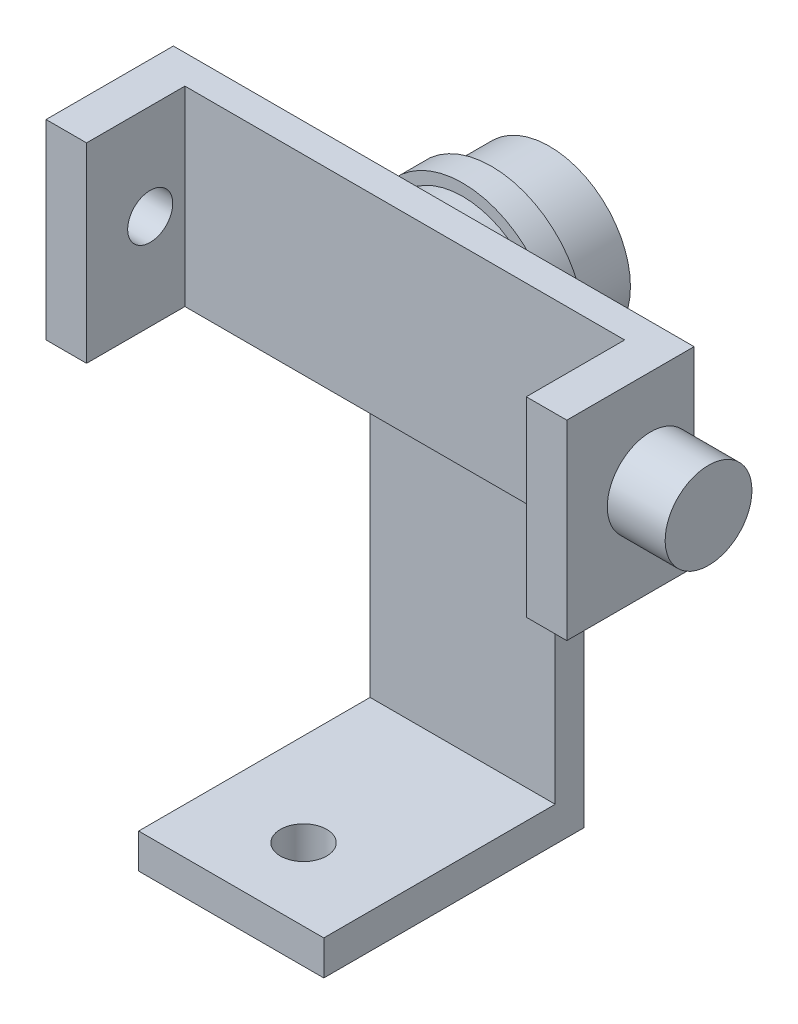
ISO-10303-21;
HEADER;
FILE_DESCRIPTION(('STEP AP214'),'2;1');
FILE_NAME('part.step','',(''),(''),'','','');
FILE_SCHEMA(('AUTOMOTIVE_DESIGN { 1 0 10303 214 1 1 1 1 }'));
ENDSEC;
DATA;
#1=APPLICATION_CONTEXT('core data for automotive mechanical design processes');
#2=APPLICATION_PROTOCOL_DEFINITION('international standard','automotive_design',2000,#1);
#3=PRODUCT_CONTEXT('',#1,'mechanical');
#4=PRODUCT('Part','Part','',(#3));
#5=PRODUCT_RELATED_PRODUCT_CATEGORY('part','',(#4));
#6=PRODUCT_DEFINITION_FORMATION('','',#4);
#7=PRODUCT_DEFINITION_CONTEXT('part definition',#1,'design');
#8=PRODUCT_DEFINITION('design','',#6,#7);
#9=PRODUCT_DEFINITION_SHAPE('','',#8);
#10=(LENGTH_UNIT() NAMED_UNIT(*) SI_UNIT(.MILLI.,.METRE.));
#11=(NAMED_UNIT(*) PLANE_ANGLE_UNIT() SI_UNIT($,.RADIAN.));
#12=(NAMED_UNIT(*) SI_UNIT($,.STERADIAN.) SOLID_ANGLE_UNIT());
#13=UNCERTAINTY_MEASURE_WITH_UNIT(LENGTH_MEASURE(1.E-05),#10,'distance_accuracy_value','');
#14=(GEOMETRIC_REPRESENTATION_CONTEXT(3) GLOBAL_UNCERTAINTY_ASSIGNED_CONTEXT((#13)) GLOBAL_UNIT_ASSIGNED_CONTEXT((#10,
#11,#12)) REPRESENTATION_CONTEXT('',''));
#15=CARTESIAN_POINT('',(0.,0.,0.));
#16=DIRECTION('',(0.,0.,1.));
#17=DIRECTION('',(1.,0.,0.));
#18=AXIS2_PLACEMENT_3D('',#15,#16,#17);
#19=CARTESIAN_POINT('',(0.,0.,-17.5));
#20=DIRECTION('',(0.,0.,1.));
#21=DIRECTION('',(1.,0.,0.));
#22=AXIS2_PLACEMENT_3D('',#19,#20,#21);
#23=PLANE('',#22);
#24=DIRECTION('',(1.,0.,0.));
#25=VECTOR('',#24,1.);
#26=CARTESIAN_POINT('',(-45.,58.5,-17.5));
#27=LINE('',#26,#25);
#28=CARTESIAN_POINT('',(-38.,58.5,-17.5));
#29=VERTEX_POINT('',#28);
#30=CARTESIAN_POINT('',(38.,58.5,-17.5));
#31=VERTEX_POINT('',#30);
#32=EDGE_CURVE('E86',#29,#31,#27,.T.);
#33=ORIENTED_EDGE('',*,*,#32,.T.);
#34=DIRECTION('',(0.,-1.,0.));
#35=VECTOR('',#34,1.);
#36=CARTESIAN_POINT('',(38.,91.5,-17.5));
#37=LINE('',#36,#35);
#38=CARTESIAN_POINT('',(38.,91.5,-17.5));
#39=VERTEX_POINT('',#38);
#40=EDGE_CURVE('E81',#39,#31,#37,.T.);
#41=ORIENTED_EDGE('',*,*,#40,.F.);
#42=DIRECTION('',(-1.,0.,0.));
#43=VECTOR('',#42,1.);
#44=CARTESIAN_POINT('',(-45.,91.5,-17.5));
#45=LINE('',#44,#43);
#46=CARTESIAN_POINT('',(-38.,91.5,-17.5));
#47=VERTEX_POINT('',#46);
#48=EDGE_CURVE('E199',#39,#47,#45,.T.);
#49=ORIENTED_EDGE('',*,*,#48,.T.);
#50=DIRECTION('',(0.,1.,0.));
#51=VECTOR('',#50,1.);
#52=CARTESIAN_POINT('',(-38.,91.5,-17.5));
#53=LINE('',#52,#51);
#54=EDGE_CURVE('E625',#29,#47,#53,.T.);
#55=ORIENTED_EDGE('',*,*,#54,.F.);
#56=EDGE_LOOP('',(#33,#41,#49,#55));
#57=FACE_BOUND('',#56,.T.);
#58=ADVANCED_FACE('F63',(#57),#23,.T.);
#59=CARTESIAN_POINT('',(-16.,6.,-32.5));
#60=DIRECTION('',(0.,0.,1.));
#61=DIRECTION('',(1.,0.,0.));
#62=AXIS2_PLACEMENT_3D('',#59,#60,#61);
#63=PLANE('',#62);
#64=CARTESIAN_POINT('',(0.,75.,-32.5));
#65=DIRECTION('',(0.,0.,1.));
#66=DIRECTION('',(1.,0.,0.));
#67=AXIS2_PLACEMENT_3D('',#64,#65,#66);
#68=CIRCLE('',#67,14.);
#69=CARTESIAN_POINT('',(14.,75.,-32.5));
#70=VERTEX_POINT('',#69);
#71=EDGE_CURVE('E217',#70,#70,#68,.T.);
#72=ORIENTED_EDGE('',*,*,#71,.T.);
#73=EDGE_LOOP('',(#72));
#74=FACE_BOUND('',#73,.T.);
#75=CARTESIAN_POINT('',(0.,75.,-32.5));
#76=DIRECTION('',(0.,0.,1.));
#77=DIRECTION('',(1.,0.,0.));
#78=AXIS2_PLACEMENT_3D('',#75,#76,#77);
#79=CIRCLE('',#78,16.);
#80=CARTESIAN_POINT('',(-16.,75.,-32.5));
#81=VERTEX_POINT('',#80);
#82=CARTESIAN_POINT('',(16.,75.,-32.5));
#83=VERTEX_POINT('',#82);
#84=EDGE_CURVE('E231',#81,#83,#79,.F.);
#85=ORIENTED_EDGE('',*,*,#84,.T.);
#86=DIRECTION('',(0.,-1.,0.));
#87=VECTOR('',#86,1.);
#88=CARTESIAN_POINT('',(16.,6.,-32.5));
#89=LINE('',#88,#87);
#90=CARTESIAN_POINT('',(16.,0.,-32.5));
#91=VERTEX_POINT('',#90);
#92=EDGE_CURVE('E280',#83,#91,#89,.T.);
#93=ORIENTED_EDGE('',*,*,#92,.T.);
#94=DIRECTION('',(-1.,0.,0.));
#95=VECTOR('',#94,1.);
#96=CARTESIAN_POINT('',(-16.,0.,-32.5));
#97=LINE('',#96,#95);
#98=CARTESIAN_POINT('',(-16.,0.,-32.5));
#99=VERTEX_POINT('',#98);
#100=EDGE_CURVE('E257',#91,#99,#97,.T.);
#101=ORIENTED_EDGE('',*,*,#100,.T.);
#102=DIRECTION('',(0.,-1.,0.));
#103=VECTOR('',#102,1.);
#104=CARTESIAN_POINT('',(-16.,6.,-32.5));
#105=LINE('',#104,#103);
#106=EDGE_CURVE('E264',#81,#99,#105,.T.);
#107=ORIENTED_EDGE('',*,*,#106,.F.);
#108=EDGE_LOOP('',(#85,#93,#101,#107));
#109=FACE_BOUND('',#108,.T.);
#110=ADVANCED_FACE('F310',(#74,#109),#63,.F.);
#111=CARTESIAN_POINT('',(-16.,91.,-27.5));
#112=DIRECTION('',(0.,0.,-1.));
#113=DIRECTION('',(-1.,0.,0.));
#114=AXIS2_PLACEMENT_3D('',#111,#112,#113);
#115=PLANE('',#114);
#116=CARTESIAN_POINT('',(0.,75.,-27.5));
#117=DIRECTION('',(0.,0.,-1.));
#118=DIRECTION('',(-1.,0.,0.));
#119=AXIS2_PLACEMENT_3D('',#116,#117,#118);
#120=CIRCLE('',#119,14.);
#121=CARTESIAN_POINT('',(-14.,75.,-27.5));
#122=VERTEX_POINT('',#121);
#123=EDGE_CURVE('E216',#122,#122,#120,.T.);
#124=ORIENTED_EDGE('',*,*,#123,.T.);
#125=EDGE_LOOP('',(#124));
#126=FACE_BOUND('',#125,.T.);
#127=DIRECTION('',(0.,-1.,0.));
#128=VECTOR('',#127,1.);
#129=CARTESIAN_POINT('',(16.,91.,-27.5));
#130=LINE('',#129,#128);
#131=CARTESIAN_POINT('',(16.,75.,-27.5));
#132=VERTEX_POINT('',#131);
#133=CARTESIAN_POINT('',(16.,6.,-27.5));
#134=VERTEX_POINT('',#133);
#135=EDGE_CURVE('E238',#132,#134,#130,.T.);
#136=ORIENTED_EDGE('',*,*,#135,.F.);
#137=CARTESIAN_POINT('',(0.,75.,-27.5));
#138=DIRECTION('',(0.,0.,1.));
#139=DIRECTION('',(1.,0.,0.));
#140=AXIS2_PLACEMENT_3D('',#137,#138,#139);
#141=CIRCLE('',#140,16.);
#142=CARTESIAN_POINT('',(-16.,75.,-27.5));
#143=VERTEX_POINT('',#142);
#144=EDGE_CURVE('E225',#143,#132,#141,.F.);
#145=ORIENTED_EDGE('',*,*,#144,.F.);
#146=DIRECTION('',(0.,-1.,0.));
#147=VECTOR('',#146,1.);
#148=CARTESIAN_POINT('',(-16.,91.,-27.5));
#149=LINE('',#148,#147);
#150=CARTESIAN_POINT('',(-16.,6.,-27.5));
#151=VERTEX_POINT('',#150);
#152=EDGE_CURVE('E241',#143,#151,#149,.T.);
#153=ORIENTED_EDGE('',*,*,#152,.T.);
#154=DIRECTION('',(1.,0.,0.));
#155=VECTOR('',#154,1.);
#156=CARTESIAN_POINT('',(-16.,6.,-27.5));
#157=LINE('',#156,#155);
#158=EDGE_CURVE('E234',#151,#134,#157,.T.);
#159=ORIENTED_EDGE('',*,*,#158,.T.);
#160=EDGE_LOOP('',(#136,#145,#153,#159));
#161=FACE_BOUND('',#160,.T.);
#162=ADVANCED_FACE('F289',(#126,#161),#115,.F.);
#163=CARTESIAN_POINT('',(16.,6.,-32.5));
#164=DIRECTION('',(-1.,0.,0.));
#165=DIRECTION('',(0.,0.,1.));
#166=AXIS2_PLACEMENT_3D('',#163,#164,#165);
#167=PLANE('',#166);
#168=DIRECTION('',(0.,0.,1.));
#169=VECTOR('',#168,1.);
#170=CARTESIAN_POINT('',(16.,75.,-112.5));
#171=LINE('',#170,#169);
#172=EDGE_CURVE('E221',#83,#132,#171,.T.);
#173=ORIENTED_EDGE('',*,*,#172,.T.);
#174=ORIENTED_EDGE('',*,*,#135,.T.);
#175=DIRECTION('',(0.,0.,-1.));
#176=VECTOR('',#175,1.);
#177=CARTESIAN_POINT('',(16.,6.,-32.5));
#178=LINE('',#177,#176);
#179=CARTESIAN_POINT('',(16.,6.,12.5));
#180=VERTEX_POINT('',#179);
#181=EDGE_CURVE('E260',#180,#134,#178,.T.);
#182=ORIENTED_EDGE('',*,*,#181,.F.);
#183=DIRECTION('',(0.,-1.,0.));
#184=VECTOR('',#183,1.);
#185=CARTESIAN_POINT('',(16.,6.,12.5));
#186=LINE('',#185,#184);
#187=CARTESIAN_POINT('',(16.,0.,12.5));
#188=VERTEX_POINT('',#187);
#189=EDGE_CURVE('E73',#180,#188,#186,.T.);
#190=ORIENTED_EDGE('',*,*,#189,.T.);
#191=DIRECTION('',(0.,0.,-1.));
#192=VECTOR('',#191,1.);
#193=CARTESIAN_POINT('',(16.,0.,-32.5));
#194=LINE('',#193,#192);
#195=EDGE_CURVE('E271',#188,#91,#194,.T.);
#196=ORIENTED_EDGE('',*,*,#195,.T.);
#197=ORIENTED_EDGE('',*,*,#92,.F.);
#198=EDGE_LOOP('',(#173,#174,#182,#190,#196,#197));
#199=FACE_BOUND('',#198,.T.);
#200=ADVANCED_FACE('F352',(#199),#167,.F.);
#201=CARTESIAN_POINT('',(0.,6.,0.));
#202=DIRECTION('',(0.,1.,0.));
#203=DIRECTION('',(0.,0.,1.));
#204=AXIS2_PLACEMENT_3D('',#201,#202,#203);
#205=PLANE('',#204);
#206=ORIENTED_EDGE('',*,*,#158,.F.);
#207=DIRECTION('',(0.,0.,1.));
#208=VECTOR('',#207,1.);
#209=CARTESIAN_POINT('',(-16.,6.,-32.5));
#210=LINE('',#209,#208);
#211=CARTESIAN_POINT('',(-16.,6.,12.5));
#212=VERTEX_POINT('',#211);
#213=EDGE_CURVE('E253',#151,#212,#210,.T.);
#214=ORIENTED_EDGE('',*,*,#213,.T.);
#215=DIRECTION('',(1.,0.,0.));
#216=VECTOR('',#215,1.);
#217=CARTESIAN_POINT('',(-16.,6.,12.5));
#218=LINE('',#217,#216);
#219=EDGE_CURVE('E256',#212,#180,#218,.T.);
#220=ORIENTED_EDGE('',*,*,#219,.T.);
#221=ORIENTED_EDGE('',*,*,#181,.T.);
#222=EDGE_LOOP('',(#206,#214,#220,#221));
#223=FACE_BOUND('',#222,.T.);
#224=CARTESIAN_POINT('',(0.,6.,0.));
#225=DIRECTION('',(0.,1.,0.));
#226=DIRECTION('',(0.,0.,1.));
#227=AXIS2_PLACEMENT_3D('',#224,#225,#226);
#228=CIRCLE('',#227,4.);
#229=CARTESIAN_POINT('',(0.,6.,4.));
#230=VERTEX_POINT('',#229);
#231=EDGE_CURVE('E245',#230,#230,#228,.T.);
#232=ORIENTED_EDGE('',*,*,#231,.F.);
#233=EDGE_LOOP('',(#232));
#234=FACE_BOUND('',#233,.T.);
#235=ADVANCED_FACE('F367',(#223,#234),#205,.T.);
#236=CARTESIAN_POINT('',(0.,0.,0.));
#237=DIRECTION('',(0.,1.,0.));
#238=DIRECTION('',(0.,0.,1.));
#239=AXIS2_PLACEMENT_3D('',#236,#237,#238);
#240=PLANE('',#239);
#241=DIRECTION('',(0.,0.,1.));
#242=VECTOR('',#241,1.);
#243=CARTESIAN_POINT('',(-16.,0.,-32.5));
#244=LINE('',#243,#242);
#245=CARTESIAN_POINT('',(-16.,0.,12.5));
#246=VERTEX_POINT('',#245);
#247=EDGE_CURVE('E249',#99,#246,#244,.T.);
#248=ORIENTED_EDGE('',*,*,#247,.F.);
#249=ORIENTED_EDGE('',*,*,#100,.F.);
#250=ORIENTED_EDGE('',*,*,#195,.F.);
#251=DIRECTION('',(1.,0.,0.));
#252=VECTOR('',#251,1.);
#253=CARTESIAN_POINT('',(-16.,0.,12.5));
#254=LINE('',#253,#252);
#255=EDGE_CURVE('E268',#246,#188,#254,.T.);
#256=ORIENTED_EDGE('',*,*,#255,.F.);
#257=EDGE_LOOP('',(#248,#249,#250,#256));
#258=FACE_BOUND('',#257,.T.);
#259=CARTESIAN_POINT('',(0.,0.,0.));
#260=DIRECTION('',(0.,1.,0.));
#261=DIRECTION('',(0.,0.,1.));
#262=AXIS2_PLACEMENT_3D('',#259,#260,#261);
#263=CIRCLE('',#262,4.);
#264=CARTESIAN_POINT('',(0.,0.,4.));
#265=VERTEX_POINT('',#264);
#266=EDGE_CURVE('E244',#265,#265,#263,.T.);
#267=ORIENTED_EDGE('',*,*,#266,.T.);
#268=EDGE_LOOP('',(#267));
#269=FACE_BOUND('',#268,.T.);
#270=ADVANCED_FACE('F359',(#258,#269),#240,.F.);
#271=CARTESIAN_POINT('',(-16.,6.,-32.5));
#272=DIRECTION('',(1.,0.,0.));
#273=DIRECTION('',(0.,0.,-1.));
#274=AXIS2_PLACEMENT_3D('',#271,#272,#273);
#275=PLANE('',#274);
#276=ORIENTED_EDGE('',*,*,#152,.F.);
#277=DIRECTION('',(0.,0.,1.));
#278=VECTOR('',#277,1.);
#279=CARTESIAN_POINT('',(-16.,75.,-112.5));
#280=LINE('',#279,#278);
#281=EDGE_CURVE('E228',#81,#143,#280,.T.);
#282=ORIENTED_EDGE('',*,*,#281,.F.);
#283=ORIENTED_EDGE('',*,*,#106,.T.);
#284=ORIENTED_EDGE('',*,*,#247,.T.);
#285=DIRECTION('',(0.,-1.,0.));
#286=VECTOR('',#285,1.);
#287=CARTESIAN_POINT('',(-16.,6.,12.5));
#288=LINE('',#287,#286);
#289=EDGE_CURVE('E12',#212,#246,#288,.T.);
#290=ORIENTED_EDGE('',*,*,#289,.F.);
#291=ORIENTED_EDGE('',*,*,#213,.F.);
#292=EDGE_LOOP('',(#276,#282,#283,#284,#290,#291));
#293=FACE_BOUND('',#292,.T.);
#294=ADVANCED_FACE('F65',(#293),#275,.F.);
#295=CARTESIAN_POINT('',(-16.,6.,12.5));
#296=DIRECTION('',(0.,0.,-1.));
#297=DIRECTION('',(-1.,0.,0.));
#298=AXIS2_PLACEMENT_3D('',#295,#296,#297);
#299=PLANE('',#298);
#300=ORIENTED_EDGE('',*,*,#255,.T.);
#301=ORIENTED_EDGE('',*,*,#189,.F.);
#302=ORIENTED_EDGE('',*,*,#219,.F.);
#303=ORIENTED_EDGE('',*,*,#289,.T.);
#304=EDGE_LOOP('',(#300,#301,#302,#303));
#305=FACE_BOUND('',#304,.T.);
#306=ADVANCED_FACE('F371',(#305),#299,.F.);
#307=CARTESIAN_POINT('',(0.,6.,0.));
#308=DIRECTION('',(0.,-1.,0.));
#309=DIRECTION('',(0.,0.,-1.));
#310=AXIS2_PLACEMENT_3D('',#307,#308,#309);
#311=CYLINDRICAL_SURFACE('',#310,4.);
#312=ORIENTED_EDGE('',*,*,#231,.T.);
#313=EDGE_LOOP('',(#312));
#314=FACE_BOUND('',#313,.T.);
#315=ORIENTED_EDGE('',*,*,#266,.F.);
#316=EDGE_LOOP('',(#315));
#317=FACE_BOUND('',#316,.T.);
#318=ADVANCED_FACE('F304',(#314,#317),#311,.F.);
#319=CARTESIAN_POINT('',(0.,75.,-112.5));
#320=DIRECTION('',(0.,0.,1.));
#321=DIRECTION('',(1.,0.,0.));
#322=AXIS2_PLACEMENT_3D('',#319,#320,#321);
#323=CYLINDRICAL_SURFACE('',#322,16.);
#324=ORIENTED_EDGE('',*,*,#281,.T.);
#325=ORIENTED_EDGE('',*,*,#144,.T.);
#326=ORIENTED_EDGE('',*,*,#172,.F.);
#327=ORIENTED_EDGE('',*,*,#84,.F.);
#328=EDGE_LOOP('',(#324,#325,#326,#327));
#329=FACE_BOUND('',#328,.T.);
#330=ADVANCED_FACE('F295',(#329),#323,.T.);
#331=CARTESIAN_POINT('',(0.,75.,-42.5));
#332=DIRECTION('',(0.,0.,1.));
#333=DIRECTION('',(1.,0.,0.));
#334=AXIS2_PLACEMENT_3D('',#331,#332,#333);
#335=CYLINDRICAL_SURFACE('',#334,14.);
#336=CARTESIAN_POINT('',(0.,75.,-22.5));
#337=DIRECTION('',(0.,0.,1.));
#338=DIRECTION('',(1.,0.,0.));
#339=AXIS2_PLACEMENT_3D('',#336,#337,#338);
#340=CIRCLE('',#339,14.);
#341=CARTESIAN_POINT('',(14.,75.,-22.5));
#342=VERTEX_POINT('',#341);
#343=EDGE_CURVE('E208',#342,#342,#340,.T.);
#344=ORIENTED_EDGE('',*,*,#343,.F.);
#345=EDGE_LOOP('',(#344));
#346=FACE_BOUND('',#345,.T.);
#347=ORIENTED_EDGE('',*,*,#123,.F.);
#348=EDGE_LOOP('',(#347));
#349=FACE_BOUND('',#348,.T.);
#350=ADVANCED_FACE('F292',(#346,#349),#335,.T.);
#351=CARTESIAN_POINT('',(0.,75.,-42.5));
#352=DIRECTION('',(0.,0.,1.));
#353=DIRECTION('',(1.,0.,0.));
#354=AXIS2_PLACEMENT_3D('',#351,#352,#353);
#355=CIRCLE('',#354,14.);
#356=CARTESIAN_POINT('',(14.,75.,-42.5));
#357=VERTEX_POINT('',#356);
#358=EDGE_CURVE('E212',#357,#357,#355,.T.);
#359=ORIENTED_EDGE('',*,*,#358,.T.);
#360=EDGE_LOOP('',(#359));
#361=FACE_BOUND('',#360,.T.);
#362=ORIENTED_EDGE('',*,*,#71,.F.);
#363=EDGE_LOOP('',(#362));
#364=FACE_BOUND('',#363,.T.);
#365=ADVANCED_FACE('F294',(#361,#364),#335,.T.);
#366=CARTESIAN_POINT('',(0.,0.,-42.5));
#367=DIRECTION('',(0.,0.,1.));
#368=DIRECTION('',(1.,0.,0.));
#369=AXIS2_PLACEMENT_3D('',#366,#367,#368);
#370=PLANE('',#369);
#371=ORIENTED_EDGE('',*,*,#358,.F.);
#372=EDGE_LOOP('',(#371));
#373=FACE_BOUND('',#372,.T.);
#374=ADVANCED_FACE('F302',(#373),#370,.F.);
#375=CARTESIAN_POINT('',(-45.,91.5,-17.5));
#376=DIRECTION('',(1.,0.,0.));
#377=DIRECTION('',(0.,1.,0.));
#378=AXIS2_PLACEMENT_3D('',#375,#376,#377);
#379=PLANE('',#378);
#380=CARTESIAN_POINT('',(-45.,75.,-11.5));
#381=DIRECTION('',(-1.,0.,0.));
#382=DIRECTION('',(0.,-1.,0.));
#383=AXIS2_PLACEMENT_3D('',#380,#381,#382);
#384=CIRCLE('',#383,3.8946994971232);
#385=CARTESIAN_POINT('',(-45.,71.1053005028768,-11.5));
#386=VERTEX_POINT('',#385);
#387=EDGE_CURVE('E601',#386,#386,#384,.T.);
#388=ORIENTED_EDGE('',*,*,#387,.F.);
#389=EDGE_LOOP('',(#388));
#390=FACE_BOUND('',#389,.T.);
#391=DIRECTION('',(0.,-1.,0.));
#392=VECTOR('',#391,1.);
#393=CARTESIAN_POINT('',(-45.,91.5,-22.5));
#394=LINE('',#393,#392);
#395=CARTESIAN_POINT('',(-45.,91.5,-22.5));
#396=VERTEX_POINT('',#395);
#397=CARTESIAN_POINT('',(-45.,58.5,-22.5));
#398=VERTEX_POINT('',#397);
#399=EDGE_CURVE('E188',#396,#398,#394,.T.);
#400=ORIENTED_EDGE('',*,*,#399,.T.);
#401=DIRECTION('',(0.,0.,-1.));
#402=VECTOR('',#401,1.);
#403=CARTESIAN_POINT('',(-45.,58.5,-17.5));
#404=LINE('',#403,#402);
#405=CARTESIAN_POINT('',(-45.,58.5,-0.499999999999997));
#406=VERTEX_POINT('',#405);
#407=EDGE_CURVE('E204',#406,#398,#404,.T.);
#408=ORIENTED_EDGE('',*,*,#407,.F.);
#409=DIRECTION('',(0.,-1.,0.));
#410=VECTOR('',#409,1.);
#411=CARTESIAN_POINT('',(-45.,91.5,-0.499999999999997));
#412=LINE('',#411,#410);
#413=CARTESIAN_POINT('',(-45.,91.5,-0.499999999999997));
#414=VERTEX_POINT('',#413);
#415=EDGE_CURVE('E639',#414,#406,#412,.T.);
#416=ORIENTED_EDGE('',*,*,#415,.F.);
#417=DIRECTION('',(0.,0.,-1.));
#418=VECTOR('',#417,1.);
#419=CARTESIAN_POINT('',(-45.,91.5,-17.5));
#420=LINE('',#419,#418);
#421=EDGE_CURVE('E194',#414,#396,#420,.T.);
#422=ORIENTED_EDGE('',*,*,#421,.T.);
#423=EDGE_LOOP('',(#400,#408,#416,#422));
#424=FACE_BOUND('',#423,.T.);
#425=ADVANCED_FACE('F333',(#390,#424),#379,.F.);
#426=CARTESIAN_POINT('',(-45.,58.5,-17.5));
#427=DIRECTION('',(0.,1.,0.));
#428=DIRECTION('',(0.,0.,1.));
#429=AXIS2_PLACEMENT_3D('',#426,#427,#428);
#430=PLANE('',#429);
#431=DIRECTION('',(1.,0.,0.));
#432=VECTOR('',#431,1.);
#433=CARTESIAN_POINT('',(-45.,58.5,-22.5));
#434=LINE('',#433,#432);
#435=CARTESIAN_POINT('',(45.,58.5,-22.5));
#436=VERTEX_POINT('',#435);
#437=EDGE_CURVE('E186',#398,#436,#434,.T.);
#438=ORIENTED_EDGE('',*,*,#437,.T.);
#439=DIRECTION('',(0.,0.,-1.));
#440=VECTOR('',#439,1.);
#441=CARTESIAN_POINT('',(45.,58.5,-17.5));
#442=LINE('',#441,#440);
#443=CARTESIAN_POINT('',(45.,58.5,-0.499999999999997));
#444=VERTEX_POINT('',#443);
#445=EDGE_CURVE('E175',#444,#436,#442,.T.);
#446=ORIENTED_EDGE('',*,*,#445,.F.);
#447=DIRECTION('',(1.,0.,0.));
#448=VECTOR('',#447,1.);
#449=CARTESIAN_POINT('',(45.,58.5,-0.499999999999997));
#450=LINE('',#449,#448);
#451=CARTESIAN_POINT('',(38.,58.5,-0.499999999999997));
#452=VERTEX_POINT('',#451);
#453=EDGE_CURVE('E622',#452,#444,#450,.T.);
#454=ORIENTED_EDGE('',*,*,#453,.F.);
#455=DIRECTION('',(0.,0.,-1.));
#456=VECTOR('',#455,1.);
#457=CARTESIAN_POINT('',(38.,58.5,-0.499999999999997));
#458=LINE('',#457,#456);
#459=EDGE_CURVE('E618',#452,#31,#458,.T.);
#460=ORIENTED_EDGE('',*,*,#459,.T.);
#461=ORIENTED_EDGE('',*,*,#32,.F.);
#462=DIRECTION('',(0.,0.,-1.));
#463=VECTOR('',#462,1.);
#464=CARTESIAN_POINT('',(-38.,58.5,-0.499999999999997));
#465=LINE('',#464,#463);
#466=CARTESIAN_POINT('',(-38.,58.5,-0.499999999999997));
#467=VERTEX_POINT('',#466);
#468=EDGE_CURVE('E660',#467,#29,#465,.T.);
#469=ORIENTED_EDGE('',*,*,#468,.F.);
#470=DIRECTION('',(1.,0.,0.));
#471=VECTOR('',#470,1.);
#472=CARTESIAN_POINT('',(-45.,58.5,-0.499999999999997));
#473=LINE('',#472,#471);
#474=EDGE_CURVE('E643',#406,#467,#473,.T.);
#475=ORIENTED_EDGE('',*,*,#474,.F.);
#476=ORIENTED_EDGE('',*,*,#407,.T.);
#477=EDGE_LOOP('',(#438,#446,#454,#460,#461,#469,#475,#476));
#478=FACE_BOUND('',#477,.T.);
#479=ADVANCED_FACE('F330',(#478),#430,.F.);
#480=CARTESIAN_POINT('',(45.,91.5,-17.5));
#481=DIRECTION('',(-1.,0.,0.));
#482=DIRECTION('',(0.,-1.,0.));
#483=AXIS2_PLACEMENT_3D('',#480,#481,#482);
#484=PLANE('',#483);
#485=DIRECTION('',(0.,1.,0.));
#486=VECTOR('',#485,1.);
#487=CARTESIAN_POINT('',(45.,91.5,-22.5));
#488=LINE('',#487,#486);
#489=CARTESIAN_POINT('',(45.,75.,-22.5));
#490=VERTEX_POINT('',#489);
#491=EDGE_CURVE('E169',#436,#490,#488,.T.);
#492=ORIENTED_EDGE('',*,*,#491,.T.);
#493=CARTESIAN_POINT('',(45.,75.,-15.));
#494=DIRECTION('',(1.,0.,0.));
#495=DIRECTION('',(0.,1.,0.));
#496=AXIS2_PLACEMENT_3D('',#493,#494,#495);
#497=CIRCLE('',#496,7.5);
#498=EDGE_CURVE('E173',#490,#490,#497,.T.);
#499=ORIENTED_EDGE('',*,*,#498,.F.);
#500=CARTESIAN_POINT('',(45.,91.5,-22.5));
#501=VERTEX_POINT('',#500);
#502=EDGE_CURVE('E179',#490,#501,#488,.T.);
#503=ORIENTED_EDGE('',*,*,#502,.T.);
#504=DIRECTION('',(0.,0.,-1.));
#505=VECTOR('',#504,1.);
#506=CARTESIAN_POINT('',(45.,91.5,-17.5));
#507=LINE('',#506,#505);
#508=CARTESIAN_POINT('',(45.,91.5,-0.499999999999997));
#509=VERTEX_POINT('',#508);
#510=EDGE_CURVE('E198',#509,#501,#507,.T.);
#511=ORIENTED_EDGE('',*,*,#510,.F.);
#512=DIRECTION('',(0.,1.,0.));
#513=VECTOR('',#512,1.);
#514=CARTESIAN_POINT('',(45.,91.5,-0.499999999999997));
#515=LINE('',#514,#513);
#516=EDGE_CURVE('E626',#444,#509,#515,.T.);
#517=ORIENTED_EDGE('',*,*,#516,.F.);
#518=ORIENTED_EDGE('',*,*,#445,.T.);
#519=EDGE_LOOP('',(#492,#499,#503,#511,#517,#518));
#520=FACE_BOUND('',#519,.T.);
#521=ADVANCED_FACE('F171',(#520),#484,.F.);
#522=CARTESIAN_POINT('',(-45.,91.5,-17.5));
#523=DIRECTION('',(0.,-1.,0.));
#524=DIRECTION('',(0.,0.,-1.));
#525=AXIS2_PLACEMENT_3D('',#522,#523,#524);
#526=PLANE('',#525);
#527=DIRECTION('',(-1.,0.,0.));
#528=VECTOR('',#527,1.);
#529=CARTESIAN_POINT('',(-45.,91.5,-22.5));
#530=LINE('',#529,#528);
#531=EDGE_CURVE('E178',#501,#396,#530,.T.);
#532=ORIENTED_EDGE('',*,*,#531,.T.);
#533=ORIENTED_EDGE('',*,*,#421,.F.);
#534=DIRECTION('',(-1.,0.,0.));
#535=VECTOR('',#534,1.);
#536=CARTESIAN_POINT('',(-45.,91.5,-0.499999999999997));
#537=LINE('',#536,#535);
#538=CARTESIAN_POINT('',(-38.,91.5,-0.499999999999997));
#539=VERTEX_POINT('',#538);
#540=EDGE_CURVE('E649',#539,#414,#537,.T.);
#541=ORIENTED_EDGE('',*,*,#540,.F.);
#542=DIRECTION('',(0.,0.,-1.));
#543=VECTOR('',#542,1.);
#544=CARTESIAN_POINT('',(-38.,91.5,-0.499999999999997));
#545=LINE('',#544,#543);
#546=EDGE_CURVE('E653',#539,#47,#545,.T.);
#547=ORIENTED_EDGE('',*,*,#546,.T.);
#548=ORIENTED_EDGE('',*,*,#48,.F.);
#549=DIRECTION('',(0.,0.,-1.));
#550=VECTOR('',#549,1.);
#551=CARTESIAN_POINT('',(38.,91.5,-0.499999999999997));
#552=LINE('',#551,#550);
#553=CARTESIAN_POINT('',(38.,91.5,-0.499999999999997));
#554=VERTEX_POINT('',#553);
#555=EDGE_CURVE('E613',#554,#39,#552,.T.);
#556=ORIENTED_EDGE('',*,*,#555,.F.);
#557=DIRECTION('',(-1.,0.,0.));
#558=VECTOR('',#557,1.);
#559=CARTESIAN_POINT('',(45.,91.5,-0.499999999999997));
#560=LINE('',#559,#558);
#561=EDGE_CURVE('E633',#509,#554,#560,.T.);
#562=ORIENTED_EDGE('',*,*,#561,.F.);
#563=ORIENTED_EDGE('',*,*,#510,.T.);
#564=EDGE_LOOP('',(#532,#533,#541,#547,#548,#556,#562,#563));
#565=FACE_BOUND('',#564,.T.);
#566=ADVANCED_FACE('F323',(#565),#526,.F.);
#567=CARTESIAN_POINT('',(0.,0.,-22.5));
#568=DIRECTION('',(0.,0.,1.));
#569=DIRECTION('',(1.,0.,0.));
#570=AXIS2_PLACEMENT_3D('',#567,#568,#569);
#571=PLANE('',#570);
#572=ORIENTED_EDGE('',*,*,#343,.T.);
#573=EDGE_LOOP('',(#572));
#574=FACE_BOUND('',#573,.T.);
#575=ORIENTED_EDGE('',*,*,#399,.F.);
#576=ORIENTED_EDGE('',*,*,#531,.F.);
#577=ORIENTED_EDGE('',*,*,#502,.F.);
#578=ORIENTED_EDGE('',*,*,#491,.F.);
#579=ORIENTED_EDGE('',*,*,#437,.F.);
#580=EDGE_LOOP('',(#575,#576,#577,#578,#579));
#581=FACE_BOUND('',#580,.T.);
#582=ADVANCED_FACE('F183',(#574,#581),#571,.F.);
#583=CARTESIAN_POINT('',(-38.,91.5,-0.499999999999997));
#584=DIRECTION('',(-1.,0.,0.));
#585=DIRECTION('',(0.,-1.,0.));
#586=AXIS2_PLACEMENT_3D('',#583,#584,#585);
#587=PLANE('',#586);
#588=CARTESIAN_POINT('',(-38.,75.,-11.5));
#589=DIRECTION('',(-1.,0.,0.));
#590=DIRECTION('',(0.,-1.,0.));
#591=AXIS2_PLACEMENT_3D('',#588,#589,#590);
#592=CIRCLE('',#591,3.8946994971232);
#593=CARTESIAN_POINT('',(-38.,71.1053005028768,-11.5));
#594=VERTEX_POINT('',#593);
#595=EDGE_CURVE('E67',#594,#594,#592,.T.);
#596=ORIENTED_EDGE('',*,*,#595,.T.);
#597=EDGE_LOOP('',(#596));
#598=FACE_BOUND('',#597,.T.);
#599=ORIENTED_EDGE('',*,*,#54,.T.);
#600=ORIENTED_EDGE('',*,*,#546,.F.);
#601=DIRECTION('',(0.,1.,0.));
#602=VECTOR('',#601,1.);
#603=CARTESIAN_POINT('',(-38.,91.5,-0.499999999999997));
#604=LINE('',#603,#602);
#605=EDGE_CURVE('E646',#467,#539,#604,.T.);
#606=ORIENTED_EDGE('',*,*,#605,.F.);
#607=ORIENTED_EDGE('',*,*,#468,.T.);
#608=EDGE_LOOP('',(#599,#600,#606,#607));
#609=FACE_BOUND('',#608,.T.);
#610=ADVANCED_FACE('F319',(#598,#609),#587,.F.);
#611=CARTESIAN_POINT('',(0.,0.,-0.499999999999997));
#612=DIRECTION('',(0.,0.,1.));
#613=DIRECTION('',(1.,0.,0.));
#614=AXIS2_PLACEMENT_3D('',#611,#612,#613);
#615=PLANE('',#614);
#616=ORIENTED_EDGE('',*,*,#415,.T.);
#617=ORIENTED_EDGE('',*,*,#474,.T.);
#618=ORIENTED_EDGE('',*,*,#605,.T.);
#619=ORIENTED_EDGE('',*,*,#540,.T.);
#620=EDGE_LOOP('',(#616,#617,#618,#619));
#621=FACE_BOUND('',#620,.T.);
#622=ADVANCED_FACE('F495',(#621),#615,.T.);
#623=CARTESIAN_POINT('',(38.,91.5,-0.499999999999997));
#624=DIRECTION('',(1.,0.,0.));
#625=DIRECTION('',(0.,1.,0.));
#626=AXIS2_PLACEMENT_3D('',#623,#624,#625);
#627=PLANE('',#626);
#628=ORIENTED_EDGE('',*,*,#40,.T.);
#629=ORIENTED_EDGE('',*,*,#459,.F.);
#630=DIRECTION('',(0.,-1.,0.));
#631=VECTOR('',#630,1.);
#632=CARTESIAN_POINT('',(38.,91.5,-0.499999999999997));
#633=LINE('',#632,#631);
#634=EDGE_CURVE('E630',#554,#452,#633,.T.);
#635=ORIENTED_EDGE('',*,*,#634,.F.);
#636=ORIENTED_EDGE('',*,*,#555,.T.);
#637=EDGE_LOOP('',(#628,#629,#635,#636));
#638=FACE_BOUND('',#637,.T.);
#639=ADVANCED_FACE('F505',(#638),#627,.F.);
#640=CARTESIAN_POINT('',(0.,0.,-0.499999999999997));
#641=DIRECTION('',(0.,0.,-1.));
#642=DIRECTION('',(-1.,0.,0.));
#643=AXIS2_PLACEMENT_3D('',#640,#641,#642);
#644=PLANE('',#643);
#645=ORIENTED_EDGE('',*,*,#516,.T.);
#646=ORIENTED_EDGE('',*,*,#561,.T.);
#647=ORIENTED_EDGE('',*,*,#634,.T.);
#648=ORIENTED_EDGE('',*,*,#453,.T.);
#649=EDGE_LOOP('',(#645,#646,#647,#648));
#650=FACE_BOUND('',#649,.T.);
#651=ADVANCED_FACE('F514',(#650),#644,.F.);
#652=CARTESIAN_POINT('',(55.,75.,-15.));
#653=DIRECTION('',(-1.,0.,0.));
#654=DIRECTION('',(0.,-1.,0.));
#655=AXIS2_PLACEMENT_3D('',#652,#653,#654);
#656=CYLINDRICAL_SURFACE('',#655,7.5);
#657=CARTESIAN_POINT('',(55.,75.,-15.));
#658=DIRECTION('',(1.,0.,0.));
#659=DIRECTION('',(0.,1.,0.));
#660=AXIS2_PLACEMENT_3D('',#657,#658,#659);
#661=CIRCLE('',#660,7.5);
#662=CARTESIAN_POINT('',(55.,82.5,-15.));
#663=VERTEX_POINT('',#662);
#664=EDGE_CURVE('E607',#663,#663,#661,.T.);
#665=ORIENTED_EDGE('',*,*,#664,.F.);
#666=EDGE_LOOP('',(#665));
#667=FACE_BOUND('',#666,.T.);
#668=ORIENTED_EDGE('',*,*,#498,.T.);
#669=EDGE_LOOP('',(#668));
#670=FACE_BOUND('',#669,.T.);
#671=ADVANCED_FACE('F524',(#667,#670),#656,.T.);
#672=CARTESIAN_POINT('',(55.,75.,-15.));
#673=DIRECTION('',(1.,0.,0.));
#674=DIRECTION('',(0.,1.,0.));
#675=AXIS2_PLACEMENT_3D('',#672,#673,#674);
#676=PLANE('',#675);
#677=ORIENTED_EDGE('',*,*,#664,.T.);
#678=EDGE_LOOP('',(#677));
#679=FACE_BOUND('',#678,.T.);
#680=ADVANCED_FACE('F534',(#679),#676,.T.);
#681=CARTESIAN_POINT('',(-35.,75.,-11.5));
#682=DIRECTION('',(-1.,0.,0.));
#683=DIRECTION('',(0.,-1.,0.));
#684=AXIS2_PLACEMENT_3D('',#681,#682,#683);
#685=CYLINDRICAL_SURFACE('',#684,3.8946994971232);
#686=ORIENTED_EDGE('',*,*,#387,.T.);
#687=EDGE_LOOP('',(#686));
#688=FACE_BOUND('',#687,.T.);
#689=ORIENTED_EDGE('',*,*,#595,.F.);
#690=EDGE_LOOP('',(#689));
#691=FACE_BOUND('',#690,.T.);
#692=ADVANCED_FACE('F544',(#688,#691),#685,.F.);
#693=CLOSED_SHELL('',(#58,#110,#162,#200,#235,#270,#294,#306,#318,#330,#350,#365,#374,#425,#479,
#521,#566,#582,#610,#622,#639,#651,#671,#680,#692));
#694=MANIFOLD_SOLID_BREP('B2',#693);
#695=ADVANCED_BREP_SHAPE_REPRESENTATION('',(#18,#694),#14);
#696=SHAPE_DEFINITION_REPRESENTATION(#9,#695);
ENDSEC;
END-ISO-10303-21;
